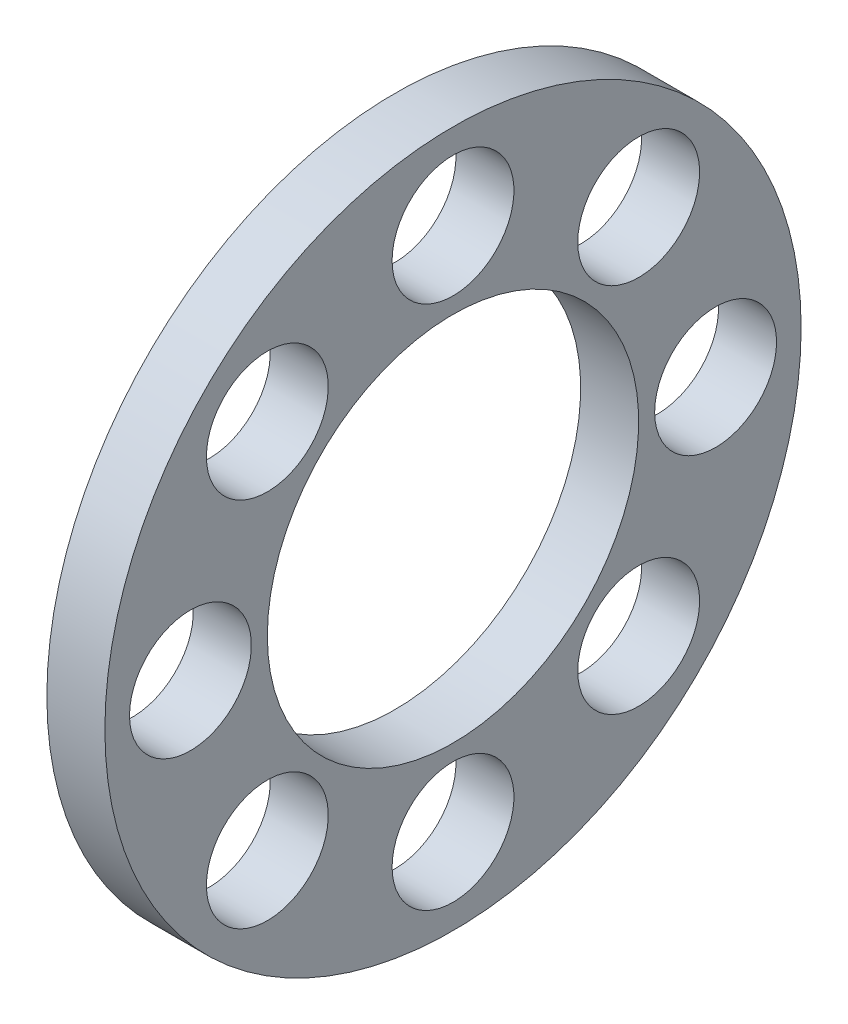
ISO-10303-21;
HEADER;
FILE_DESCRIPTION(('STEP AP214'),'2;1');
FILE_NAME('part.step','',(''),(''),'','','');
FILE_SCHEMA(('AUTOMOTIVE_DESIGN { 1 0 10303 214 1 1 1 1 }'));
ENDSEC;
DATA;
#1=APPLICATION_CONTEXT('core data for automotive mechanical design processes');
#2=APPLICATION_PROTOCOL_DEFINITION('international standard','automotive_design',2000,#1);
#3=PRODUCT_CONTEXT('',#1,'mechanical');
#4=PRODUCT('Part','Part','',(#3));
#5=PRODUCT_RELATED_PRODUCT_CATEGORY('part','',(#4));
#6=PRODUCT_DEFINITION_FORMATION('','',#4);
#7=PRODUCT_DEFINITION_CONTEXT('part definition',#1,'design');
#8=PRODUCT_DEFINITION('design','',#6,#7);
#9=PRODUCT_DEFINITION_SHAPE('','',#8);
#10=(LENGTH_UNIT() NAMED_UNIT(*) SI_UNIT(.MILLI.,.METRE.));
#11=(NAMED_UNIT(*) PLANE_ANGLE_UNIT() SI_UNIT($,.RADIAN.));
#12=(NAMED_UNIT(*) SI_UNIT($,.STERADIAN.) SOLID_ANGLE_UNIT());
#13=UNCERTAINTY_MEASURE_WITH_UNIT(LENGTH_MEASURE(1.E-05),#10,'distance_accuracy_value','');
#14=(GEOMETRIC_REPRESENTATION_CONTEXT(3) GLOBAL_UNCERTAINTY_ASSIGNED_CONTEXT((#13)) GLOBAL_UNIT_ASSIGNED_CONTEXT((#10,
#11,#12)) REPRESENTATION_CONTEXT('',''));
#15=CARTESIAN_POINT('',(0.,0.,0.));
#16=DIRECTION('',(0.,0.,1.));
#17=DIRECTION('',(1.,0.,0.));
#18=AXIS2_PLACEMENT_3D('',#15,#16,#17);
#19=CARTESIAN_POINT('',(-1.1113,0.,0.));
#20=DIRECTION('',(1.,0.,0.));
#21=DIRECTION('',(0.,0.,-1.));
#22=AXIS2_PLACEMENT_3D('',#19,#20,#21);
#23=CYLINDRICAL_SURFACE('',#22,8.);
#24=CARTESIAN_POINT('',(-1.1113,0.,0.));
#25=DIRECTION('',(-1.,0.,0.));
#26=DIRECTION('',(0.,0.,1.));
#27=AXIS2_PLACEMENT_3D('',#24,#25,#26);
#28=CIRCLE('',#27,8.);
#29=CARTESIAN_POINT('',(-1.1113,0.,8.));
#30=VERTEX_POINT('',#29);
#31=EDGE_CURVE('E45',#30,#30,#28,.T.);
#32=ORIENTED_EDGE('',*,*,#31,.T.);
#33=EDGE_LOOP('',(#32));
#34=FACE_BOUND('',#33,.T.);
#35=CARTESIAN_POINT('',(1.3887,0.,0.));
#36=DIRECTION('',(-1.,0.,0.));
#37=DIRECTION('',(0.,0.,1.));
#38=AXIS2_PLACEMENT_3D('',#35,#36,#37);
#39=CIRCLE('',#38,8.);
#40=CARTESIAN_POINT('',(1.3887,0.,8.));
#41=VERTEX_POINT('',#40);
#42=EDGE_CURVE('E77',#41,#41,#39,.T.);
#43=ORIENTED_EDGE('',*,*,#42,.F.);
#44=EDGE_LOOP('',(#43));
#45=FACE_BOUND('',#44,.T.);
#46=ADVANCED_FACE('F37',(#34,#45),#23,.F.);
#47=CARTESIAN_POINT('',(-1.1113,11.3137084989848,1.37910516340156E-13));
#48=DIRECTION('',(1.,0.,0.));
#49=DIRECTION('',(0.,0.,-1.));
#50=AXIS2_PLACEMENT_3D('',#47,#48,#49);
#51=CYLINDRICAL_SURFACE('',#50,2.625);
#52=CARTESIAN_POINT('',(-1.1113,11.3137084989848,1.37910516340156E-13));
#53=DIRECTION('',(-1.,0.,0.));
#54=DIRECTION('',(0.,0.,1.));
#55=AXIS2_PLACEMENT_3D('',#52,#53,#54);
#56=CIRCLE('',#55,2.625);
#57=CARTESIAN_POINT('',(-1.1113,11.3137084989848,2.62500000000014));
#58=VERTEX_POINT('',#57);
#59=EDGE_CURVE('E50',#58,#58,#56,.T.);
#60=ORIENTED_EDGE('',*,*,#59,.T.);
#61=EDGE_LOOP('',(#60));
#62=FACE_BOUND('',#61,.T.);
#63=CARTESIAN_POINT('',(1.3887,11.3137084989848,1.37910516340156E-13));
#64=DIRECTION('',(-1.,0.,0.));
#65=DIRECTION('',(0.,0.,1.));
#66=AXIS2_PLACEMENT_3D('',#63,#64,#65);
#67=CIRCLE('',#66,2.625);
#68=CARTESIAN_POINT('',(1.3887,11.3137084989848,2.62500000000014));
#69=VERTEX_POINT('',#68);
#70=EDGE_CURVE('E75',#69,#69,#67,.T.);
#71=ORIENTED_EDGE('',*,*,#70,.F.);
#72=EDGE_LOOP('',(#71));
#73=FACE_BOUND('',#72,.T.);
#74=ADVANCED_FACE('F110',(#62,#73),#51,.F.);
#75=CARTESIAN_POINT('',(-1.1113,7.9999999999999,8.0000000000001));
#76=DIRECTION('',(1.,0.,0.));
#77=DIRECTION('',(0.,0.,-1.));
#78=AXIS2_PLACEMENT_3D('',#75,#76,#77);
#79=CYLINDRICAL_SURFACE('',#78,2.625);
#80=CARTESIAN_POINT('',(-1.1113,7.9999999999999,8.0000000000001));
#81=DIRECTION('',(-1.,0.,0.));
#82=DIRECTION('',(0.,0.,1.));
#83=AXIS2_PLACEMENT_3D('',#80,#81,#82);
#84=CIRCLE('',#83,2.625);
#85=CARTESIAN_POINT('',(-1.1113,7.9999999999999,10.6250000000001));
#86=VERTEX_POINT('',#85);
#87=EDGE_CURVE('E105',#86,#86,#84,.T.);
#88=ORIENTED_EDGE('',*,*,#87,.T.);
#89=EDGE_LOOP('',(#88));
#90=FACE_BOUND('',#89,.T.);
#91=CARTESIAN_POINT('',(1.3887,7.9999999999999,8.0000000000001));
#92=DIRECTION('',(-1.,0.,0.));
#93=DIRECTION('',(0.,0.,1.));
#94=AXIS2_PLACEMENT_3D('',#91,#92,#93);
#95=CIRCLE('',#94,2.625);
#96=CARTESIAN_POINT('',(1.3887,7.9999999999999,10.6250000000001));
#97=VERTEX_POINT('',#96);
#98=EDGE_CURVE('E72',#97,#97,#95,.T.);
#99=ORIENTED_EDGE('',*,*,#98,.F.);
#100=EDGE_LOOP('',(#99));
#101=FACE_BOUND('',#100,.T.);
#102=ADVANCED_FACE('F128',(#90,#101),#79,.F.);
#103=CARTESIAN_POINT('',(-1.1113,-1.37043154602168E-13,11.3137084989848));
#104=DIRECTION('',(1.,0.,0.));
#105=DIRECTION('',(0.,0.,-1.));
#106=AXIS2_PLACEMENT_3D('',#103,#104,#105);
#107=CYLINDRICAL_SURFACE('',#106,2.625);
#108=CARTESIAN_POINT('',(-1.1113,-1.37043154602168E-13,11.3137084989848));
#109=DIRECTION('',(-1.,0.,0.));
#110=DIRECTION('',(0.,0.,1.));
#111=AXIS2_PLACEMENT_3D('',#108,#109,#110);
#112=CIRCLE('',#111,2.625);
#113=CARTESIAN_POINT('',(-1.1113,-1.37043154602168E-13,13.9387084989848));
#114=VERTEX_POINT('',#113);
#115=EDGE_CURVE('E102',#114,#114,#112,.T.);
#116=ORIENTED_EDGE('',*,*,#115,.T.);
#117=EDGE_LOOP('',(#116));
#118=FACE_BOUND('',#117,.T.);
#119=CARTESIAN_POINT('',(1.3887,-1.37043154602168E-13,11.3137084989848));
#120=DIRECTION('',(-1.,0.,0.));
#121=DIRECTION('',(0.,0.,1.));
#122=AXIS2_PLACEMENT_3D('',#119,#120,#121);
#123=CIRCLE('',#122,2.625);
#124=CARTESIAN_POINT('',(1.3887,-1.37043154602168E-13,13.9387084989848));
#125=VERTEX_POINT('',#124);
#126=EDGE_CURVE('E69',#125,#125,#123,.T.);
#127=ORIENTED_EDGE('',*,*,#126,.F.);
#128=EDGE_LOOP('',(#127));
#129=FACE_BOUND('',#128,.T.);
#130=ADVANCED_FACE('F135',(#118,#129),#107,.F.);
#131=CARTESIAN_POINT('',(-1.1113,-8.0000000000001,7.9999999999999));
#132=DIRECTION('',(1.,0.,0.));
#133=DIRECTION('',(0.,0.,-1.));
#134=AXIS2_PLACEMENT_3D('',#131,#132,#133);
#135=CYLINDRICAL_SURFACE('',#134,2.625);
#136=CARTESIAN_POINT('',(-1.1113,-8.0000000000001,7.9999999999999));
#137=DIRECTION('',(-1.,0.,0.));
#138=DIRECTION('',(0.,0.,1.));
#139=AXIS2_PLACEMENT_3D('',#136,#137,#138);
#140=CIRCLE('',#139,2.625);
#141=CARTESIAN_POINT('',(-1.1113,-8.0000000000001,10.6249999999999));
#142=VERTEX_POINT('',#141);
#143=EDGE_CURVE('E99',#142,#142,#140,.T.);
#144=ORIENTED_EDGE('',*,*,#143,.T.);
#145=EDGE_LOOP('',(#144));
#146=FACE_BOUND('',#145,.T.);
#147=CARTESIAN_POINT('',(1.3887,-8.0000000000001,7.9999999999999));
#148=DIRECTION('',(-1.,0.,0.));
#149=DIRECTION('',(0.,0.,1.));
#150=AXIS2_PLACEMENT_3D('',#147,#148,#149);
#151=CIRCLE('',#150,2.625);
#152=CARTESIAN_POINT('',(1.3887,-8.0000000000001,10.6249999999999));
#153=VERTEX_POINT('',#152);
#154=EDGE_CURVE('E66',#153,#153,#151,.T.);
#155=ORIENTED_EDGE('',*,*,#154,.F.);
#156=EDGE_LOOP('',(#155));
#157=FACE_BOUND('',#156,.T.);
#158=ADVANCED_FACE('F139',(#146,#157),#135,.F.);
#159=CARTESIAN_POINT('',(-1.1113,-11.3137084989848,-1.37043154602168E-13));
#160=DIRECTION('',(1.,0.,0.));
#161=DIRECTION('',(0.,0.,-1.));
#162=AXIS2_PLACEMENT_3D('',#159,#160,#161);
#163=CYLINDRICAL_SURFACE('',#162,2.625);
#164=CARTESIAN_POINT('',(-1.1113,-11.3137084989848,-1.37043154602168E-13));
#165=DIRECTION('',(-1.,0.,0.));
#166=DIRECTION('',(0.,0.,1.));
#167=AXIS2_PLACEMENT_3D('',#164,#165,#166);
#168=CIRCLE('',#167,2.625);
#169=CARTESIAN_POINT('',(-1.1113,-11.3137084989848,2.62499999999986));
#170=VERTEX_POINT('',#169);
#171=EDGE_CURVE('E96',#170,#170,#168,.T.);
#172=ORIENTED_EDGE('',*,*,#171,.T.);
#173=EDGE_LOOP('',(#172));
#174=FACE_BOUND('',#173,.T.);
#175=CARTESIAN_POINT('',(1.3887,-11.3137084989848,-1.37043154602168E-13));
#176=DIRECTION('',(-1.,0.,0.));
#177=DIRECTION('',(0.,0.,1.));
#178=AXIS2_PLACEMENT_3D('',#175,#176,#177);
#179=CIRCLE('',#178,2.625);
#180=CARTESIAN_POINT('',(1.3887,-11.3137084989848,2.62499999999986));
#181=VERTEX_POINT('',#180);
#182=EDGE_CURVE('E63',#181,#181,#179,.T.);
#183=ORIENTED_EDGE('',*,*,#182,.F.);
#184=EDGE_LOOP('',(#183));
#185=FACE_BOUND('',#184,.T.);
#186=ADVANCED_FACE('F143',(#174,#185),#163,.F.);
#187=CARTESIAN_POINT('',(-1.1113,-7.9999999999999,-8.0000000000001));
#188=DIRECTION('',(1.,0.,0.));
#189=DIRECTION('',(0.,0.,-1.));
#190=AXIS2_PLACEMENT_3D('',#187,#188,#189);
#191=CYLINDRICAL_SURFACE('',#190,2.625);
#192=CARTESIAN_POINT('',(-1.1113,-7.9999999999999,-8.0000000000001));
#193=DIRECTION('',(-1.,0.,0.));
#194=DIRECTION('',(0.,0.,1.));
#195=AXIS2_PLACEMENT_3D('',#192,#193,#194);
#196=CIRCLE('',#195,2.625);
#197=CARTESIAN_POINT('',(-1.1113,-7.9999999999999,-5.3750000000001));
#198=VERTEX_POINT('',#197);
#199=EDGE_CURVE('E91',#198,#198,#196,.T.);
#200=ORIENTED_EDGE('',*,*,#199,.T.);
#201=EDGE_LOOP('',(#200));
#202=FACE_BOUND('',#201,.T.);
#203=CARTESIAN_POINT('',(1.3887,-7.9999999999999,-8.0000000000001));
#204=DIRECTION('',(-1.,0.,0.));
#205=DIRECTION('',(0.,0.,1.));
#206=AXIS2_PLACEMENT_3D('',#203,#204,#205);
#207=CIRCLE('',#206,2.625);
#208=CARTESIAN_POINT('',(1.3887,-7.9999999999999,-5.3750000000001));
#209=VERTEX_POINT('',#208);
#210=EDGE_CURVE('E60',#209,#209,#207,.T.);
#211=ORIENTED_EDGE('',*,*,#210,.F.);
#212=EDGE_LOOP('',(#211));
#213=FACE_BOUND('',#212,.T.);
#214=ADVANCED_FACE('F147',(#202,#213),#191,.F.);
#215=CARTESIAN_POINT('',(-1.1113,1.36175792864179E-13,-11.3137084989848));
#216=DIRECTION('',(1.,0.,0.));
#217=DIRECTION('',(0.,0.,-1.));
#218=AXIS2_PLACEMENT_3D('',#215,#216,#217);
#219=CYLINDRICAL_SURFACE('',#218,2.625);
#220=CARTESIAN_POINT('',(-1.1113,1.36175792864179E-13,-11.3137084989848));
#221=DIRECTION('',(-1.,0.,0.));
#222=DIRECTION('',(0.,0.,1.));
#223=AXIS2_PLACEMENT_3D('',#220,#221,#222);
#224=CIRCLE('',#223,2.625);
#225=CARTESIAN_POINT('',(-1.1113,1.36175792864179E-13,-8.68870849898476));
#226=VERTEX_POINT('',#225);
#227=EDGE_CURVE('E86',#226,#226,#224,.T.);
#228=ORIENTED_EDGE('',*,*,#227,.T.);
#229=EDGE_LOOP('',(#228));
#230=FACE_BOUND('',#229,.T.);
#231=CARTESIAN_POINT('',(1.3887,1.36175792864179E-13,-11.3137084989848));
#232=DIRECTION('',(-1.,0.,0.));
#233=DIRECTION('',(0.,0.,1.));
#234=AXIS2_PLACEMENT_3D('',#231,#232,#233);
#235=CIRCLE('',#234,2.625);
#236=CARTESIAN_POINT('',(1.3887,1.36175792864179E-13,-8.68870849898476));
#237=VERTEX_POINT('',#236);
#238=EDGE_CURVE('E57',#237,#237,#235,.T.);
#239=ORIENTED_EDGE('',*,*,#238,.F.);
#240=EDGE_LOOP('',(#239));
#241=FACE_BOUND('',#240,.T.);
#242=ADVANCED_FACE('F150',(#230,#241),#219,.F.);
#243=CARTESIAN_POINT('',(-1.1113,8.0000000000001,-7.9999999999999));
#244=DIRECTION('',(1.,0.,0.));
#245=DIRECTION('',(0.,0.,-1.));
#246=AXIS2_PLACEMENT_3D('',#243,#244,#245);
#247=CYLINDRICAL_SURFACE('',#246,2.625);
#248=CARTESIAN_POINT('',(-1.1113,8.0000000000001,-7.9999999999999));
#249=DIRECTION('',(-1.,0.,0.));
#250=DIRECTION('',(0.,0.,1.));
#251=AXIS2_PLACEMENT_3D('',#248,#249,#250);
#252=CIRCLE('',#251,2.625);
#253=CARTESIAN_POINT('',(-1.1113,8.0000000000001,-5.3749999999999));
#254=VERTEX_POINT('',#253);
#255=EDGE_CURVE('E82',#254,#254,#252,.T.);
#256=ORIENTED_EDGE('',*,*,#255,.T.);
#257=EDGE_LOOP('',(#256));
#258=FACE_BOUND('',#257,.T.);
#259=CARTESIAN_POINT('',(1.3887,8.0000000000001,-7.9999999999999));
#260=DIRECTION('',(-1.,0.,0.));
#261=DIRECTION('',(0.,0.,1.));
#262=AXIS2_PLACEMENT_3D('',#259,#260,#261);
#263=CIRCLE('',#262,2.625);
#264=CARTESIAN_POINT('',(1.3887,8.0000000000001,-5.3749999999999));
#265=VERTEX_POINT('',#264);
#266=EDGE_CURVE('E54',#265,#265,#263,.T.);
#267=ORIENTED_EDGE('',*,*,#266,.F.);
#268=EDGE_LOOP('',(#267));
#269=FACE_BOUND('',#268,.T.);
#270=ADVANCED_FACE('F39',(#258,#269),#247,.F.);
#271=CARTESIAN_POINT('',(-1.1113,0.,0.));
#272=DIRECTION('',(1.,0.,0.));
#273=DIRECTION('',(0.,0.,-1.));
#274=AXIS2_PLACEMENT_3D('',#271,#272,#273);
#275=CYLINDRICAL_SURFACE('',#274,15.);
#276=CARTESIAN_POINT('',(-1.1113,0.,0.));
#277=DIRECTION('',(-1.,0.,0.));
#278=DIRECTION('',(0.,0.,1.));
#279=AXIS2_PLACEMENT_3D('',#276,#277,#278);
#280=CIRCLE('',#279,15.);
#281=CARTESIAN_POINT('',(-1.1113,0.,15.));
#282=VERTEX_POINT('',#281);
#283=EDGE_CURVE('E10',#282,#282,#280,.T.);
#284=ORIENTED_EDGE('',*,*,#283,.F.);
#285=EDGE_LOOP('',(#284));
#286=FACE_BOUND('',#285,.T.);
#287=CARTESIAN_POINT('',(1.3887,0.,0.));
#288=DIRECTION('',(-1.,0.,0.));
#289=DIRECTION('',(0.,0.,1.));
#290=AXIS2_PLACEMENT_3D('',#287,#288,#289);
#291=CIRCLE('',#290,15.);
#292=CARTESIAN_POINT('',(1.3887,0.,15.));
#293=VERTEX_POINT('',#292);
#294=EDGE_CURVE('E41',#293,#293,#291,.T.);
#295=ORIENTED_EDGE('',*,*,#294,.T.);
#296=EDGE_LOOP('',(#295));
#297=FACE_BOUND('',#296,.T.);
#298=ADVANCED_FACE('F117',(#286,#297),#275,.T.);
#299=CARTESIAN_POINT('',(-1.1113,0.,0.));
#300=DIRECTION('',(-1.,0.,0.));
#301=DIRECTION('',(0.,0.,1.));
#302=AXIS2_PLACEMENT_3D('',#299,#300,#301);
#303=PLANE('',#302);
#304=ORIENTED_EDGE('',*,*,#255,.F.);
#305=EDGE_LOOP('',(#304));
#306=FACE_BOUND('',#305,.T.);
#307=ORIENTED_EDGE('',*,*,#227,.F.);
#308=EDGE_LOOP('',(#307));
#309=FACE_BOUND('',#308,.T.);
#310=ORIENTED_EDGE('',*,*,#199,.F.);
#311=EDGE_LOOP('',(#310));
#312=FACE_BOUND('',#311,.T.);
#313=ORIENTED_EDGE('',*,*,#171,.F.);
#314=EDGE_LOOP('',(#313));
#315=FACE_BOUND('',#314,.T.);
#316=ORIENTED_EDGE('',*,*,#143,.F.);
#317=EDGE_LOOP('',(#316));
#318=FACE_BOUND('',#317,.T.);
#319=ORIENTED_EDGE('',*,*,#115,.F.);
#320=EDGE_LOOP('',(#319));
#321=FACE_BOUND('',#320,.T.);
#322=ORIENTED_EDGE('',*,*,#87,.F.);
#323=EDGE_LOOP('',(#322));
#324=FACE_BOUND('',#323,.T.);
#325=ORIENTED_EDGE('',*,*,#59,.F.);
#326=EDGE_LOOP('',(#325));
#327=FACE_BOUND('',#326,.T.);
#328=ORIENTED_EDGE('',*,*,#31,.F.);
#329=EDGE_LOOP('',(#328));
#330=FACE_BOUND('',#329,.T.);
#331=ORIENTED_EDGE('',*,*,#283,.T.);
#332=EDGE_LOOP('',(#331));
#333=FACE_BOUND('',#332,.T.);
#334=ADVANCED_FACE('F113',(#306,#309,#312,#315,#318,#321,#324,#327,#330,#333),#303,.T.);
#335=CARTESIAN_POINT('',(1.3887,0.,0.));
#336=DIRECTION('',(-1.,0.,0.));
#337=DIRECTION('',(0.,0.,1.));
#338=AXIS2_PLACEMENT_3D('',#335,#336,#337);
#339=PLANE('',#338);
#340=ORIENTED_EDGE('',*,*,#266,.T.);
#341=EDGE_LOOP('',(#340));
#342=FACE_BOUND('',#341,.T.);
#343=ORIENTED_EDGE('',*,*,#238,.T.);
#344=EDGE_LOOP('',(#343));
#345=FACE_BOUND('',#344,.T.);
#346=ORIENTED_EDGE('',*,*,#210,.T.);
#347=EDGE_LOOP('',(#346));
#348=FACE_BOUND('',#347,.T.);
#349=ORIENTED_EDGE('',*,*,#182,.T.);
#350=EDGE_LOOP('',(#349));
#351=FACE_BOUND('',#350,.T.);
#352=ORIENTED_EDGE('',*,*,#154,.T.);
#353=EDGE_LOOP('',(#352));
#354=FACE_BOUND('',#353,.T.);
#355=ORIENTED_EDGE('',*,*,#126,.T.);
#356=EDGE_LOOP('',(#355));
#357=FACE_BOUND('',#356,.T.);
#358=ORIENTED_EDGE('',*,*,#98,.T.);
#359=EDGE_LOOP('',(#358));
#360=FACE_BOUND('',#359,.T.);
#361=ORIENTED_EDGE('',*,*,#70,.T.);
#362=EDGE_LOOP('',(#361));
#363=FACE_BOUND('',#362,.T.);
#364=ORIENTED_EDGE('',*,*,#42,.T.);
#365=EDGE_LOOP('',(#364));
#366=FACE_BOUND('',#365,.T.);
#367=ORIENTED_EDGE('',*,*,#294,.F.);
#368=EDGE_LOOP('',(#367));
#369=FACE_BOUND('',#368,.T.);
#370=ADVANCED_FACE('F116',(#342,#345,#348,#351,#354,#357,#360,#363,#366,#369),#339,.F.);
#371=CLOSED_SHELL('',(#46,#74,#102,#130,#158,#186,#214,#242,#270,#298,#334,#370));
#372=MANIFOLD_SOLID_BREP('B2',#371);
#373=ADVANCED_BREP_SHAPE_REPRESENTATION('',(#18,#372),#14);
#374=SHAPE_DEFINITION_REPRESENTATION(#9,#373);
ENDSEC;
END-ISO-10303-21;
